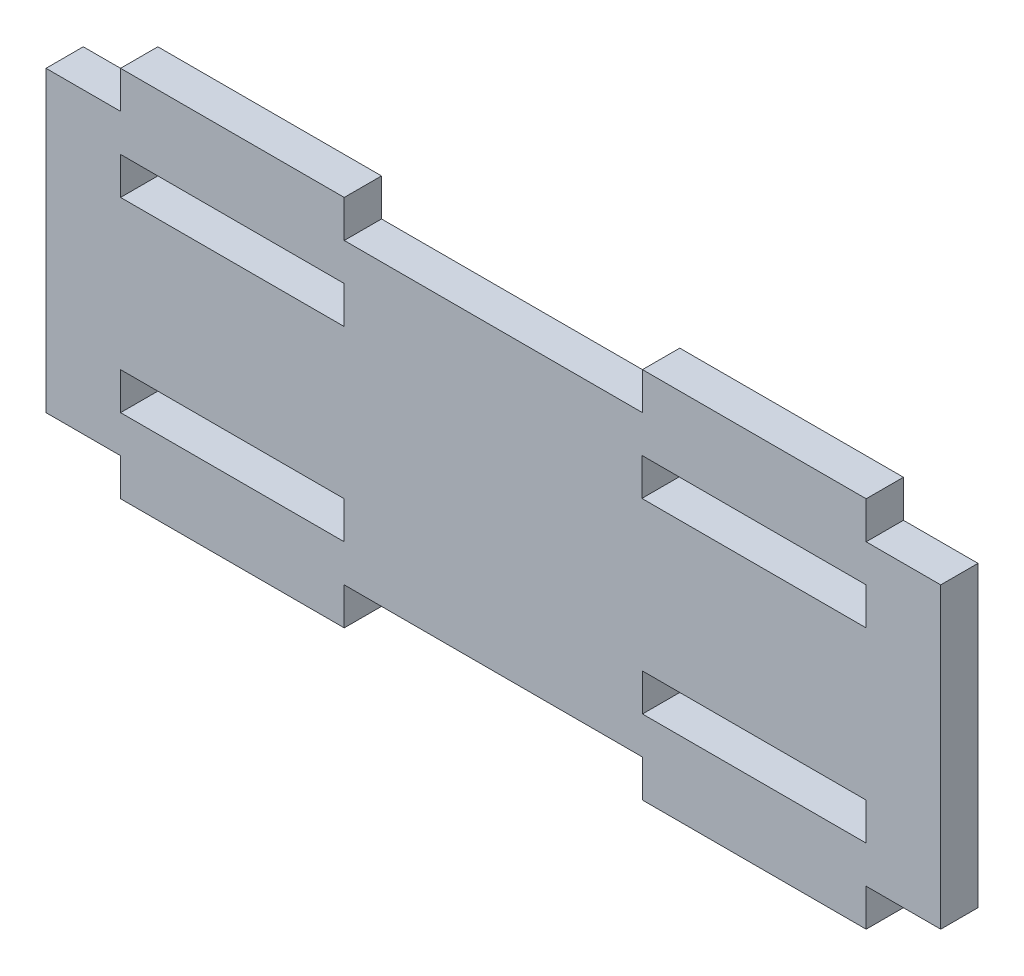
ISO-10303-21;
HEADER;
FILE_DESCRIPTION(('STEP AP214'),'2;1');
FILE_NAME('part.step','',(''),(''),'','','');
FILE_SCHEMA(('AUTOMOTIVE_DESIGN { 1 0 10303 214 1 1 1 1 }'));
ENDSEC;
DATA;
#1=APPLICATION_CONTEXT('core data for automotive mechanical design processes');
#2=APPLICATION_PROTOCOL_DEFINITION('international standard','automotive_design',2000,#1);
#3=PRODUCT_CONTEXT('',#1,'mechanical');
#4=PRODUCT('Part','Part','',(#3));
#5=PRODUCT_RELATED_PRODUCT_CATEGORY('part','',(#4));
#6=PRODUCT_DEFINITION_FORMATION('','',#4);
#7=PRODUCT_DEFINITION_CONTEXT('part definition',#1,'design');
#8=PRODUCT_DEFINITION('design','',#6,#7);
#9=PRODUCT_DEFINITION_SHAPE('','',#8);
#10=(LENGTH_UNIT() NAMED_UNIT(*) SI_UNIT(.MILLI.,.METRE.));
#11=(NAMED_UNIT(*) PLANE_ANGLE_UNIT() SI_UNIT($,.RADIAN.));
#12=(NAMED_UNIT(*) SI_UNIT($,.STERADIAN.) SOLID_ANGLE_UNIT());
#13=UNCERTAINTY_MEASURE_WITH_UNIT(LENGTH_MEASURE(1.E-05),#10,'distance_accuracy_value','');
#14=(GEOMETRIC_REPRESENTATION_CONTEXT(3) GLOBAL_UNCERTAINTY_ASSIGNED_CONTEXT((#13)) GLOBAL_UNIT_ASSIGNED_CONTEXT((#10,
#11,#12)) REPRESENTATION_CONTEXT('',''));
#15=CARTESIAN_POINT('',(0.,0.,0.));
#16=DIRECTION('',(0.,0.,1.));
#17=DIRECTION('',(1.,0.,0.));
#18=AXIS2_PLACEMENT_3D('',#15,#16,#17);
#19=CARTESIAN_POINT('',(0.,-9.99999999999999,5.));
#20=DIRECTION('',(0.,1.,0.));
#21=DIRECTION('',(0.,0.,1.));
#22=AXIS2_PLACEMENT_3D('',#19,#20,#21);
#23=PLANE('',#22);
#24=DIRECTION('',(1.,0.,0.));
#25=VECTOR('',#24,1.);
#26=CARTESIAN_POINT('',(0.,-9.99999999999999,0.));
#27=LINE('',#26,#25);
#28=CARTESIAN_POINT('',(20.,-9.99999999999999,0.));
#29=VERTEX_POINT('',#28);
#30=CARTESIAN_POINT('',(50.,-9.99999999999999,0.));
#31=VERTEX_POINT('',#30);
#32=EDGE_CURVE('E386',#29,#31,#27,.T.);
#33=ORIENTED_EDGE('',*,*,#32,.T.);
#34=DIRECTION('',(0.,0.,-1.));
#35=VECTOR('',#34,1.);
#36=CARTESIAN_POINT('',(50.,-9.99999999999999,5.));
#37=LINE('',#36,#35);
#38=CARTESIAN_POINT('',(50.,-9.99999999999999,5.));
#39=VERTEX_POINT('',#38);
#40=EDGE_CURVE('E11',#39,#31,#37,.T.);
#41=ORIENTED_EDGE('',*,*,#40,.F.);
#42=DIRECTION('',(1.,0.,0.));
#43=VECTOR('',#42,1.);
#44=CARTESIAN_POINT('',(0.,-9.99999999999999,5.));
#45=LINE('',#44,#43);
#46=CARTESIAN_POINT('',(20.,-9.99999999999999,5.));
#47=VERTEX_POINT('',#46);
#48=EDGE_CURVE('E282',#47,#39,#45,.T.);
#49=ORIENTED_EDGE('',*,*,#48,.F.);
#50=DIRECTION('',(0.,0.,-1.));
#51=VECTOR('',#50,1.);
#52=CARTESIAN_POINT('',(20.,-9.99999999999999,5.));
#53=LINE('',#52,#51);
#54=EDGE_CURVE('E54',#47,#29,#53,.T.);
#55=ORIENTED_EDGE('',*,*,#54,.T.);
#56=EDGE_LOOP('',(#33,#41,#49,#55));
#57=FACE_BOUND('',#56,.T.);
#58=ADVANCED_FACE('F35',(#57),#23,.F.);
#59=CARTESIAN_POINT('',(50.,0.,5.));
#60=DIRECTION('',(1.,0.,0.));
#61=DIRECTION('',(0.,0.,-1.));
#62=AXIS2_PLACEMENT_3D('',#59,#60,#61);
#63=PLANE('',#62);
#64=DIRECTION('',(0.,-1.,0.));
#65=VECTOR('',#64,1.);
#66=CARTESIAN_POINT('',(50.,0.,0.));
#67=LINE('',#66,#65);
#68=CARTESIAN_POINT('',(50.,-15.,0.));
#69=VERTEX_POINT('',#68);
#70=EDGE_CURVE('E288',#31,#69,#67,.T.);
#71=ORIENTED_EDGE('',*,*,#70,.T.);
#72=DIRECTION('',(0.,0.,-1.));
#73=VECTOR('',#72,1.);
#74=CARTESIAN_POINT('',(50.,-15.,5.));
#75=LINE('',#74,#73);
#76=CARTESIAN_POINT('',(50.,-15.,5.));
#77=VERTEX_POINT('',#76);
#78=EDGE_CURVE('E45',#77,#69,#75,.T.);
#79=ORIENTED_EDGE('',*,*,#78,.F.);
#80=DIRECTION('',(0.,-1.,0.));
#81=VECTOR('',#80,1.);
#82=CARTESIAN_POINT('',(50.,0.,5.));
#83=LINE('',#82,#81);
#84=EDGE_CURVE('E276',#39,#77,#83,.T.);
#85=ORIENTED_EDGE('',*,*,#84,.F.);
#86=ORIENTED_EDGE('',*,*,#40,.T.);
#87=EDGE_LOOP('',(#71,#79,#85,#86));
#88=FACE_BOUND('',#87,.T.);
#89=ADVANCED_FACE('F287',(#88),#63,.F.);
#90=CARTESIAN_POINT('',(0.,-15.,5.));
#91=DIRECTION('',(0.,1.,0.));
#92=DIRECTION('',(-1.,0.,0.));
#93=AXIS2_PLACEMENT_3D('',#90,#91,#92);
#94=PLANE('',#93);
#95=DIRECTION('',(1.,0.,0.));
#96=VECTOR('',#95,1.);
#97=CARTESIAN_POINT('',(0.,-15.,0.));
#98=LINE('',#97,#96);
#99=CARTESIAN_POINT('',(20.,-15.,0.));
#100=VERTEX_POINT('',#99);
#101=EDGE_CURVE('E389',#100,#69,#98,.T.);
#102=ORIENTED_EDGE('',*,*,#101,.F.);
#103=DIRECTION('',(0.,0.,-1.));
#104=VECTOR('',#103,1.);
#105=CARTESIAN_POINT('',(20.,-15.,5.));
#106=LINE('',#105,#104);
#107=CARTESIAN_POINT('',(20.,-15.,5.));
#108=VERTEX_POINT('',#107);
#109=EDGE_CURVE('E164',#108,#100,#106,.T.);
#110=ORIENTED_EDGE('',*,*,#109,.F.);
#111=DIRECTION('',(1.,0.,0.));
#112=VECTOR('',#111,1.);
#113=CARTESIAN_POINT('',(0.,-15.,5.));
#114=LINE('',#113,#112);
#115=EDGE_CURVE('E281',#108,#77,#114,.T.);
#116=ORIENTED_EDGE('',*,*,#115,.T.);
#117=ORIENTED_EDGE('',*,*,#78,.T.);
#118=EDGE_LOOP('',(#102,#110,#116,#117));
#119=FACE_BOUND('',#118,.T.);
#120=ADVANCED_FACE('F292',(#119),#94,.T.);
#121=CARTESIAN_POINT('',(0.,-9.99999999999999,5.));
#122=DIRECTION('',(0.,1.,0.));
#123=DIRECTION('',(0.,0.,1.));
#124=AXIS2_PLACEMENT_3D('',#121,#122,#123);
#125=PLANE('',#124);
#126=DIRECTION('',(1.,0.,0.));
#127=VECTOR('',#126,1.);
#128=CARTESIAN_POINT('',(0.,-9.99999999999999,0.));
#129=LINE('',#128,#127);
#130=CARTESIAN_POINT('',(-50.,-9.99999999999999,0.));
#131=VERTEX_POINT('',#130);
#132=CARTESIAN_POINT('',(-20.,-9.99999999999999,0.));
#133=VERTEX_POINT('',#132);
#134=EDGE_CURVE('E374',#131,#133,#129,.T.);
#135=ORIENTED_EDGE('',*,*,#134,.T.);
#136=DIRECTION('',(0.,0.,-1.));
#137=VECTOR('',#136,1.);
#138=CARTESIAN_POINT('',(-20.,-9.99999999999999,5.));
#139=LINE('',#138,#137);
#140=CARTESIAN_POINT('',(-20.,-9.99999999999999,5.));
#141=VERTEX_POINT('',#140);
#142=EDGE_CURVE('E396',#141,#133,#139,.T.);
#143=ORIENTED_EDGE('',*,*,#142,.F.);
#144=DIRECTION('',(1.,0.,0.));
#145=VECTOR('',#144,1.);
#146=CARTESIAN_POINT('',(0.,-9.99999999999999,5.));
#147=LINE('',#146,#145);
#148=CARTESIAN_POINT('',(-50.,-9.99999999999999,5.));
#149=VERTEX_POINT('',#148);
#150=EDGE_CURVE('E549',#149,#141,#147,.T.);
#151=ORIENTED_EDGE('',*,*,#150,.F.);
#152=DIRECTION('',(0.,0.,-1.));
#153=VECTOR('',#152,1.);
#154=CARTESIAN_POINT('',(-50.,-9.99999999999999,5.));
#155=LINE('',#154,#153);
#156=EDGE_CURVE('E398',#149,#131,#155,.T.);
#157=ORIENTED_EDGE('',*,*,#156,.T.);
#158=EDGE_LOOP('',(#135,#143,#151,#157));
#159=FACE_BOUND('',#158,.T.);
#160=ADVANCED_FACE('F575',(#159),#125,.F.);
#161=CARTESIAN_POINT('',(-20.,0.,5.));
#162=DIRECTION('',(1.,0.,0.));
#163=DIRECTION('',(0.,0.,-1.));
#164=AXIS2_PLACEMENT_3D('',#161,#162,#163);
#165=PLANE('',#164);
#166=DIRECTION('',(0.,-1.,0.));
#167=VECTOR('',#166,1.);
#168=CARTESIAN_POINT('',(-20.,0.,0.));
#169=LINE('',#168,#167);
#170=CARTESIAN_POINT('',(-20.,-15.,0.));
#171=VERTEX_POINT('',#170);
#172=EDGE_CURVE('E377',#133,#171,#169,.T.);
#173=ORIENTED_EDGE('',*,*,#172,.T.);
#174=DIRECTION('',(0.,0.,-1.));
#175=VECTOR('',#174,1.);
#176=CARTESIAN_POINT('',(-20.,-15.,5.));
#177=LINE('',#176,#175);
#178=CARTESIAN_POINT('',(-20.,-15.,5.));
#179=VERTEX_POINT('',#178);
#180=EDGE_CURVE('E403',#179,#171,#177,.T.);
#181=ORIENTED_EDGE('',*,*,#180,.F.);
#182=DIRECTION('',(0.,-1.,0.));
#183=VECTOR('',#182,1.);
#184=CARTESIAN_POINT('',(-20.,0.,5.));
#185=LINE('',#184,#183);
#186=EDGE_CURVE('E552',#141,#179,#185,.T.);
#187=ORIENTED_EDGE('',*,*,#186,.F.);
#188=ORIENTED_EDGE('',*,*,#142,.T.);
#189=EDGE_LOOP('',(#173,#181,#187,#188));
#190=FACE_BOUND('',#189,.T.);
#191=ADVANCED_FACE('F577',(#190),#165,.F.);
#192=CARTESIAN_POINT('',(0.,-15.,5.));
#193=DIRECTION('',(0.,1.,0.));
#194=DIRECTION('',(0.,0.,1.));
#195=AXIS2_PLACEMENT_3D('',#192,#193,#194);
#196=PLANE('',#195);
#197=DIRECTION('',(1.,0.,0.));
#198=VECTOR('',#197,1.);
#199=CARTESIAN_POINT('',(0.,-15.,0.));
#200=LINE('',#199,#198);
#201=CARTESIAN_POINT('',(-50.,-15.,0.));
#202=VERTEX_POINT('',#201);
#203=EDGE_CURVE('E380',#202,#171,#200,.T.);
#204=ORIENTED_EDGE('',*,*,#203,.F.);
#205=DIRECTION('',(0.,0.,-1.));
#206=VECTOR('',#205,1.);
#207=CARTESIAN_POINT('',(-50.,-15.,5.));
#208=LINE('',#207,#206);
#209=CARTESIAN_POINT('',(-50.,-15.,5.));
#210=VERTEX_POINT('',#209);
#211=EDGE_CURVE('E400',#210,#202,#208,.T.);
#212=ORIENTED_EDGE('',*,*,#211,.F.);
#213=DIRECTION('',(1.,0.,0.));
#214=VECTOR('',#213,1.);
#215=CARTESIAN_POINT('',(0.,-15.,5.));
#216=LINE('',#215,#214);
#217=EDGE_CURVE('E554',#210,#179,#216,.T.);
#218=ORIENTED_EDGE('',*,*,#217,.T.);
#219=ORIENTED_EDGE('',*,*,#180,.T.);
#220=EDGE_LOOP('',(#204,#212,#218,#219));
#221=FACE_BOUND('',#220,.T.);
#222=ADVANCED_FACE('F570',(#221),#196,.T.);
#223=CARTESIAN_POINT('',(0.,15.,5.));
#224=DIRECTION('',(0.,1.,0.));
#225=DIRECTION('',(0.,0.,1.));
#226=AXIS2_PLACEMENT_3D('',#223,#224,#225);
#227=PLANE('',#226);
#228=DIRECTION('',(1.,0.,0.));
#229=VECTOR('',#228,1.);
#230=CARTESIAN_POINT('',(0.,15.,0.));
#231=LINE('',#230,#229);
#232=CARTESIAN_POINT('',(-50.,15.,0.));
#233=VERTEX_POINT('',#232);
#234=CARTESIAN_POINT('',(-20.,15.,0.));
#235=VERTEX_POINT('',#234);
#236=EDGE_CURVE('E362',#233,#235,#231,.T.);
#237=ORIENTED_EDGE('',*,*,#236,.T.);
#238=DIRECTION('',(0.,0.,-1.));
#239=VECTOR('',#238,1.);
#240=CARTESIAN_POINT('',(-20.,15.,5.));
#241=LINE('',#240,#239);
#242=CARTESIAN_POINT('',(-20.,15.,5.));
#243=VERTEX_POINT('',#242);
#244=EDGE_CURVE('E401',#243,#235,#241,.T.);
#245=ORIENTED_EDGE('',*,*,#244,.F.);
#246=DIRECTION('',(1.,0.,0.));
#247=VECTOR('',#246,1.);
#248=CARTESIAN_POINT('',(0.,15.,5.));
#249=LINE('',#248,#247);
#250=CARTESIAN_POINT('',(-50.,15.,5.));
#251=VERTEX_POINT('',#250);
#252=EDGE_CURVE('E538',#251,#243,#249,.T.);
#253=ORIENTED_EDGE('',*,*,#252,.F.);
#254=DIRECTION('',(0.,0.,-1.));
#255=VECTOR('',#254,1.);
#256=CARTESIAN_POINT('',(-50.,15.,5.));
#257=LINE('',#256,#255);
#258=EDGE_CURVE('E407',#251,#233,#257,.T.);
#259=ORIENTED_EDGE('',*,*,#258,.T.);
#260=EDGE_LOOP('',(#237,#245,#253,#259));
#261=FACE_BOUND('',#260,.T.);
#262=ADVANCED_FACE('F584',(#261),#227,.F.);
#263=CARTESIAN_POINT('',(-20.,0.,5.));
#264=DIRECTION('',(1.,0.,0.));
#265=DIRECTION('',(0.,0.,-1.));
#266=AXIS2_PLACEMENT_3D('',#263,#264,#265);
#267=PLANE('',#266);
#268=DIRECTION('',(0.,-1.,0.));
#269=VECTOR('',#268,1.);
#270=CARTESIAN_POINT('',(-20.,0.,0.));
#271=LINE('',#270,#269);
#272=CARTESIAN_POINT('',(-20.,10.,0.));
#273=VERTEX_POINT('',#272);
#274=EDGE_CURVE('E365',#235,#273,#271,.T.);
#275=ORIENTED_EDGE('',*,*,#274,.T.);
#276=DIRECTION('',(0.,0.,-1.));
#277=VECTOR('',#276,1.);
#278=CARTESIAN_POINT('',(-20.,10.,5.));
#279=LINE('',#278,#277);
#280=CARTESIAN_POINT('',(-20.,10.,5.));
#281=VERTEX_POINT('',#280);
#282=EDGE_CURVE('E412',#281,#273,#279,.T.);
#283=ORIENTED_EDGE('',*,*,#282,.F.);
#284=DIRECTION('',(0.,-1.,0.));
#285=VECTOR('',#284,1.);
#286=CARTESIAN_POINT('',(-20.,0.,5.));
#287=LINE('',#286,#285);
#288=EDGE_CURVE('E541',#243,#281,#287,.T.);
#289=ORIENTED_EDGE('',*,*,#288,.F.);
#290=ORIENTED_EDGE('',*,*,#244,.T.);
#291=EDGE_LOOP('',(#275,#283,#289,#290));
#292=FACE_BOUND('',#291,.T.);
#293=ADVANCED_FACE('F682',(#292),#267,.F.);
#294=CARTESIAN_POINT('',(0.,10.,5.));
#295=DIRECTION('',(0.,1.,0.));
#296=DIRECTION('',(0.,0.,1.));
#297=AXIS2_PLACEMENT_3D('',#294,#295,#296);
#298=PLANE('',#297);
#299=DIRECTION('',(1.,0.,0.));
#300=VECTOR('',#299,1.);
#301=CARTESIAN_POINT('',(0.,10.,0.));
#302=LINE('',#301,#300);
#303=CARTESIAN_POINT('',(-50.,10.,0.));
#304=VERTEX_POINT('',#303);
#305=EDGE_CURVE('E368',#304,#273,#302,.T.);
#306=ORIENTED_EDGE('',*,*,#305,.F.);
#307=DIRECTION('',(0.,0.,-1.));
#308=VECTOR('',#307,1.);
#309=CARTESIAN_POINT('',(-50.,10.,5.));
#310=LINE('',#309,#308);
#311=CARTESIAN_POINT('',(-50.,10.,5.));
#312=VERTEX_POINT('',#311);
#313=EDGE_CURVE('E409',#312,#304,#310,.T.);
#314=ORIENTED_EDGE('',*,*,#313,.F.);
#315=DIRECTION('',(1.,0.,0.));
#316=VECTOR('',#315,1.);
#317=CARTESIAN_POINT('',(0.,10.,5.));
#318=LINE('',#317,#316);
#319=EDGE_CURVE('E543',#312,#281,#318,.T.);
#320=ORIENTED_EDGE('',*,*,#319,.T.);
#321=ORIENTED_EDGE('',*,*,#282,.T.);
#322=EDGE_LOOP('',(#306,#314,#320,#321));
#323=FACE_BOUND('',#322,.T.);
#324=ADVANCED_FACE('F616',(#323),#298,.T.);
#325=CARTESIAN_POINT('',(60.,0.,5.));
#326=DIRECTION('',(1.,0.,0.));
#327=DIRECTION('',(0.,1.,0.));
#328=AXIS2_PLACEMENT_3D('',#325,#326,#327);
#329=PLANE('',#328);
#330=DIRECTION('',(0.,-1.,0.));
#331=VECTOR('',#330,1.);
#332=CARTESIAN_POINT('',(60.,0.,0.));
#333=LINE('',#332,#331);
#334=CARTESIAN_POINT('',(60.,20.,0.));
#335=VERTEX_POINT('',#334);
#336=CARTESIAN_POINT('',(60.,-20.,0.));
#337=VERTEX_POINT('',#336);
#338=EDGE_CURVE('E310',#335,#337,#333,.T.);
#339=ORIENTED_EDGE('',*,*,#338,.F.);
#340=DIRECTION('',(0.,0.,-1.));
#341=VECTOR('',#340,1.);
#342=CARTESIAN_POINT('',(60.,20.,5.));
#343=LINE('',#342,#341);
#344=CARTESIAN_POINT('',(60.,20.,5.));
#345=VERTEX_POINT('',#344);
#346=EDGE_CURVE('E410',#345,#335,#343,.T.);
#347=ORIENTED_EDGE('',*,*,#346,.F.);
#348=DIRECTION('',(0.,-1.,0.));
#349=VECTOR('',#348,1.);
#350=CARTESIAN_POINT('',(60.,0.,5.));
#351=LINE('',#350,#349);
#352=CARTESIAN_POINT('',(60.,-20.,5.));
#353=VERTEX_POINT('',#352);
#354=EDGE_CURVE('E485',#345,#353,#351,.T.);
#355=ORIENTED_EDGE('',*,*,#354,.T.);
#356=DIRECTION('',(0.,0.,-1.));
#357=VECTOR('',#356,1.);
#358=CARTESIAN_POINT('',(60.,-20.,5.));
#359=LINE('',#358,#357);
#360=EDGE_CURVE('E416',#353,#337,#359,.T.);
#361=ORIENTED_EDGE('',*,*,#360,.T.);
#362=EDGE_LOOP('',(#339,#347,#355,#361));
#363=FACE_BOUND('',#362,.T.);
#364=ADVANCED_FACE('F612',(#363),#329,.T.);
#365=CARTESIAN_POINT('',(0.,20.,5.));
#366=DIRECTION('',(0.,1.,0.));
#367=DIRECTION('',(0.,0.,1.));
#368=AXIS2_PLACEMENT_3D('',#365,#366,#367);
#369=PLANE('',#368);
#370=DIRECTION('',(1.,0.,0.));
#371=VECTOR('',#370,1.);
#372=CARTESIAN_POINT('',(0.,20.,0.));
#373=LINE('',#372,#371);
#374=CARTESIAN_POINT('',(50.,20.,0.));
#375=VERTEX_POINT('',#374);
#376=EDGE_CURVE('E313',#375,#335,#373,.T.);
#377=ORIENTED_EDGE('',*,*,#376,.F.);
#378=DIRECTION('',(0.,0.,-1.));
#379=VECTOR('',#378,1.);
#380=CARTESIAN_POINT('',(50.,20.,5.));
#381=LINE('',#380,#379);
#382=CARTESIAN_POINT('',(50.,20.,5.));
#383=VERTEX_POINT('',#382);
#384=EDGE_CURVE('E457',#383,#375,#381,.T.);
#385=ORIENTED_EDGE('',*,*,#384,.F.);
#386=DIRECTION('',(1.,0.,0.));
#387=VECTOR('',#386,1.);
#388=CARTESIAN_POINT('',(0.,20.,5.));
#389=LINE('',#388,#387);
#390=EDGE_CURVE('E489',#383,#345,#389,.T.);
#391=ORIENTED_EDGE('',*,*,#390,.T.);
#392=ORIENTED_EDGE('',*,*,#346,.T.);
#393=EDGE_LOOP('',(#377,#385,#391,#392));
#394=FACE_BOUND('',#393,.T.);
#395=ADVANCED_FACE('F615',(#394),#369,.T.);
#396=CARTESIAN_POINT('',(50.,0.,5.));
#397=DIRECTION('',(-1.,0.,0.));
#398=DIRECTION('',(0.,0.,1.));
#399=AXIS2_PLACEMENT_3D('',#396,#397,#398);
#400=PLANE('',#399);
#401=DIRECTION('',(0.,1.,0.));
#402=VECTOR('',#401,1.);
#403=CARTESIAN_POINT('',(50.,0.,0.));
#404=LINE('',#403,#402);
#405=CARTESIAN_POINT('',(50.,25.,0.));
#406=VERTEX_POINT('',#405);
#407=EDGE_CURVE('E316',#375,#406,#404,.T.);
#408=ORIENTED_EDGE('',*,*,#407,.T.);
#409=DIRECTION('',(0.,0.,-1.));
#410=VECTOR('',#409,1.);
#411=CARTESIAN_POINT('',(50.,25.,5.));
#412=LINE('',#411,#410);
#413=CARTESIAN_POINT('',(50.,25.,5.));
#414=VERTEX_POINT('',#413);
#415=EDGE_CURVE('E455',#414,#406,#412,.T.);
#416=ORIENTED_EDGE('',*,*,#415,.F.);
#417=DIRECTION('',(0.,1.,0.));
#418=VECTOR('',#417,1.);
#419=CARTESIAN_POINT('',(50.,0.,5.));
#420=LINE('',#419,#418);
#421=EDGE_CURVE('E496',#383,#414,#420,.T.);
#422=ORIENTED_EDGE('',*,*,#421,.F.);
#423=ORIENTED_EDGE('',*,*,#384,.T.);
#424=EDGE_LOOP('',(#408,#416,#422,#423));
#425=FACE_BOUND('',#424,.T.);
#426=ADVANCED_FACE('F618',(#425),#400,.F.);
#427=CARTESIAN_POINT('',(0.,25.,5.));
#428=DIRECTION('',(0.,1.,0.));
#429=DIRECTION('',(0.,0.,1.));
#430=AXIS2_PLACEMENT_3D('',#427,#428,#429);
#431=PLANE('',#430);
#432=DIRECTION('',(1.,0.,0.));
#433=VECTOR('',#432,1.);
#434=CARTESIAN_POINT('',(0.,25.,0.));
#435=LINE('',#434,#433);
#436=CARTESIAN_POINT('',(20.,25.,0.));
#437=VERTEX_POINT('',#436);
#438=EDGE_CURVE('E321',#437,#406,#435,.T.);
#439=ORIENTED_EDGE('',*,*,#438,.F.);
#440=DIRECTION('',(0.,0.,-1.));
#441=VECTOR('',#440,1.);
#442=CARTESIAN_POINT('',(20.,25.,5.));
#443=LINE('',#442,#441);
#444=CARTESIAN_POINT('',(20.,25.,5.));
#445=VERTEX_POINT('',#444);
#446=EDGE_CURVE('E453',#445,#437,#443,.T.);
#447=ORIENTED_EDGE('',*,*,#446,.F.);
#448=DIRECTION('',(1.,0.,0.));
#449=VECTOR('',#448,1.);
#450=CARTESIAN_POINT('',(0.,25.,5.));
#451=LINE('',#450,#449);
#452=EDGE_CURVE('E500',#445,#414,#451,.T.);
#453=ORIENTED_EDGE('',*,*,#452,.T.);
#454=ORIENTED_EDGE('',*,*,#415,.T.);
#455=EDGE_LOOP('',(#439,#447,#453,#454));
#456=FACE_BOUND('',#455,.T.);
#457=ADVANCED_FACE('F621',(#456),#431,.T.);
#458=CARTESIAN_POINT('',(20.,0.,5.));
#459=DIRECTION('',(-1.,0.,0.));
#460=DIRECTION('',(0.,0.,1.));
#461=AXIS2_PLACEMENT_3D('',#458,#459,#460);
#462=PLANE('',#461);
#463=DIRECTION('',(0.,1.,0.));
#464=VECTOR('',#463,1.);
#465=CARTESIAN_POINT('',(20.,0.,0.));
#466=LINE('',#465,#464);
#467=CARTESIAN_POINT('',(20.,20.,0.));
#468=VERTEX_POINT('',#467);
#469=EDGE_CURVE('E324',#468,#437,#466,.T.);
#470=ORIENTED_EDGE('',*,*,#469,.F.);
#471=DIRECTION('',(0.,0.,-1.));
#472=VECTOR('',#471,1.);
#473=CARTESIAN_POINT('',(20.,20.,5.));
#474=LINE('',#473,#472);
#475=CARTESIAN_POINT('',(20.,20.,5.));
#476=VERTEX_POINT('',#475);
#477=EDGE_CURVE('E451',#476,#468,#474,.T.);
#478=ORIENTED_EDGE('',*,*,#477,.F.);
#479=DIRECTION('',(0.,1.,0.));
#480=VECTOR('',#479,1.);
#481=CARTESIAN_POINT('',(20.,0.,5.));
#482=LINE('',#481,#480);
#483=EDGE_CURVE('E503',#476,#445,#482,.T.);
#484=ORIENTED_EDGE('',*,*,#483,.T.);
#485=ORIENTED_EDGE('',*,*,#446,.T.);
#486=EDGE_LOOP('',(#470,#478,#484,#485));
#487=FACE_BOUND('',#486,.T.);
#488=ADVANCED_FACE('F625',(#487),#462,.T.);
#489=CARTESIAN_POINT('',(-20.,20.,0.));
#490=VERTEX_POINT('',#489);
#491=EDGE_CURVE('E318',#490,#468,#373,.T.);
#492=ORIENTED_EDGE('',*,*,#491,.F.);
#493=DIRECTION('',(0.,0.,-1.));
#494=VECTOR('',#493,1.);
#495=CARTESIAN_POINT('',(-20.,20.,5.));
#496=LINE('',#495,#494);
#497=CARTESIAN_POINT('',(-20.,20.,5.));
#498=VERTEX_POINT('',#497);
#499=EDGE_CURVE('E449',#498,#490,#496,.T.);
#500=ORIENTED_EDGE('',*,*,#499,.F.);
#501=EDGE_CURVE('E498',#498,#476,#389,.T.);
#502=ORIENTED_EDGE('',*,*,#501,.T.);
#503=ORIENTED_EDGE('',*,*,#477,.T.);
#504=EDGE_LOOP('',(#492,#500,#502,#503));
#505=FACE_BOUND('',#504,.T.);
#506=ADVANCED_FACE('F629',(#505),#369,.T.);
#507=CARTESIAN_POINT('',(-20.,0.,5.));
#508=DIRECTION('',(-1.,0.,0.));
#509=DIRECTION('',(0.,0.,1.));
#510=AXIS2_PLACEMENT_3D('',#507,#508,#509);
#511=PLANE('',#510);
#512=DIRECTION('',(0.,1.,0.));
#513=VECTOR('',#512,1.);
#514=CARTESIAN_POINT('',(-20.,0.,0.));
#515=LINE('',#514,#513);
#516=CARTESIAN_POINT('',(-20.,25.,0.));
#517=VERTEX_POINT('',#516);
#518=EDGE_CURVE('E327',#490,#517,#515,.T.);
#519=ORIENTED_EDGE('',*,*,#518,.T.);
#520=DIRECTION('',(0.,0.,-1.));
#521=VECTOR('',#520,1.);
#522=CARTESIAN_POINT('',(-20.,25.,5.));
#523=LINE('',#522,#521);
#524=CARTESIAN_POINT('',(-20.,25.,5.));
#525=VERTEX_POINT('',#524);
#526=EDGE_CURVE('E447',#525,#517,#523,.T.);
#527=ORIENTED_EDGE('',*,*,#526,.F.);
#528=DIRECTION('',(0.,1.,0.));
#529=VECTOR('',#528,1.);
#530=CARTESIAN_POINT('',(-20.,0.,5.));
#531=LINE('',#530,#529);
#532=EDGE_CURVE('E506',#498,#525,#531,.T.);
#533=ORIENTED_EDGE('',*,*,#532,.F.);
#534=ORIENTED_EDGE('',*,*,#499,.T.);
#535=EDGE_LOOP('',(#519,#527,#533,#534));
#536=FACE_BOUND('',#535,.T.);
#537=ADVANCED_FACE('F631',(#536),#511,.F.);
#538=CARTESIAN_POINT('',(0.,25.,5.));
#539=DIRECTION('',(0.,1.,0.));
#540=DIRECTION('',(0.,0.,1.));
#541=AXIS2_PLACEMENT_3D('',#538,#539,#540);
#542=PLANE('',#541);
#543=DIRECTION('',(1.,0.,0.));
#544=VECTOR('',#543,1.);
#545=CARTESIAN_POINT('',(0.,25.,0.));
#546=LINE('',#545,#544);
#547=CARTESIAN_POINT('',(-50.,25.,0.));
#548=VERTEX_POINT('',#547);
#549=EDGE_CURVE('E330',#548,#517,#546,.T.);
#550=ORIENTED_EDGE('',*,*,#549,.F.);
#551=DIRECTION('',(0.,0.,-1.));
#552=VECTOR('',#551,1.);
#553=CARTESIAN_POINT('',(-50.,25.,5.));
#554=LINE('',#553,#552);
#555=CARTESIAN_POINT('',(-50.,25.,5.));
#556=VERTEX_POINT('',#555);
#557=EDGE_CURVE('E445',#556,#548,#554,.T.);
#558=ORIENTED_EDGE('',*,*,#557,.F.);
#559=DIRECTION('',(1.,0.,0.));
#560=VECTOR('',#559,1.);
#561=CARTESIAN_POINT('',(0.,25.,5.));
#562=LINE('',#561,#560);
#563=EDGE_CURVE('E508',#556,#525,#562,.T.);
#564=ORIENTED_EDGE('',*,*,#563,.T.);
#565=ORIENTED_EDGE('',*,*,#526,.T.);
#566=EDGE_LOOP('',(#550,#558,#564,#565));
#567=FACE_BOUND('',#566,.T.);
#568=ADVANCED_FACE('F634',(#567),#542,.T.);
#569=CARTESIAN_POINT('',(-50.,0.,5.));
#570=DIRECTION('',(-1.,0.,0.));
#571=DIRECTION('',(0.,0.,1.));
#572=AXIS2_PLACEMENT_3D('',#569,#570,#571);
#573=PLANE('',#572);
#574=DIRECTION('',(0.,1.,0.));
#575=VECTOR('',#574,1.);
#576=CARTESIAN_POINT('',(-50.,0.,0.));
#577=LINE('',#576,#575);
#578=CARTESIAN_POINT('',(-50.,20.,0.));
#579=VERTEX_POINT('',#578);
#580=EDGE_CURVE('E333',#579,#548,#577,.T.);
#581=ORIENTED_EDGE('',*,*,#580,.F.);
#582=DIRECTION('',(0.,0.,-1.));
#583=VECTOR('',#582,1.);
#584=CARTESIAN_POINT('',(-50.,20.,5.));
#585=LINE('',#584,#583);
#586=CARTESIAN_POINT('',(-50.,20.,5.));
#587=VERTEX_POINT('',#586);
#588=EDGE_CURVE('E443',#587,#579,#585,.T.);
#589=ORIENTED_EDGE('',*,*,#588,.F.);
#590=DIRECTION('',(0.,1.,0.));
#591=VECTOR('',#590,1.);
#592=CARTESIAN_POINT('',(-50.,0.,5.));
#593=LINE('',#592,#591);
#594=EDGE_CURVE('E511',#587,#556,#593,.T.);
#595=ORIENTED_EDGE('',*,*,#594,.T.);
#596=ORIENTED_EDGE('',*,*,#557,.T.);
#597=EDGE_LOOP('',(#581,#589,#595,#596));
#598=FACE_BOUND('',#597,.T.);
#599=ADVANCED_FACE('F638',(#598),#573,.T.);
#600=CARTESIAN_POINT('',(-60.,20.,0.));
#601=VERTEX_POINT('',#600);
#602=EDGE_CURVE('E317',#601,#579,#373,.T.);
#603=ORIENTED_EDGE('',*,*,#602,.F.);
#604=DIRECTION('',(0.,0.,-1.));
#605=VECTOR('',#604,1.);
#606=CARTESIAN_POINT('',(-60.,20.,5.));
#607=LINE('',#606,#605);
#608=CARTESIAN_POINT('',(-60.,20.,5.));
#609=VERTEX_POINT('',#608);
#610=EDGE_CURVE('E441',#609,#601,#607,.T.);
#611=ORIENTED_EDGE('',*,*,#610,.F.);
#612=EDGE_CURVE('E497',#609,#587,#389,.T.);
#613=ORIENTED_EDGE('',*,*,#612,.T.);
#614=ORIENTED_EDGE('',*,*,#588,.T.);
#615=EDGE_LOOP('',(#603,#611,#613,#614));
#616=FACE_BOUND('',#615,.T.);
#617=ADVANCED_FACE('F642',(#616),#369,.T.);
#618=CARTESIAN_POINT('',(-60.,0.,5.));
#619=DIRECTION('',(1.,0.,0.));
#620=DIRECTION('',(0.,0.,-1.));
#621=AXIS2_PLACEMENT_3D('',#618,#619,#620);
#622=PLANE('',#621);
#623=DIRECTION('',(0.,-1.,0.));
#624=VECTOR('',#623,1.);
#625=CARTESIAN_POINT('',(-60.,0.,0.));
#626=LINE('',#625,#624);
#627=CARTESIAN_POINT('',(-60.,-20.,0.));
#628=VERTEX_POINT('',#627);
#629=EDGE_CURVE('E336',#601,#628,#626,.T.);
#630=ORIENTED_EDGE('',*,*,#629,.T.);
#631=DIRECTION('',(0.,0.,-1.));
#632=VECTOR('',#631,1.);
#633=CARTESIAN_POINT('',(-60.,-20.,5.));
#634=LINE('',#633,#632);
#635=CARTESIAN_POINT('',(-60.,-20.,5.));
#636=VERTEX_POINT('',#635);
#637=EDGE_CURVE('E438',#636,#628,#634,.T.);
#638=ORIENTED_EDGE('',*,*,#637,.F.);
#639=DIRECTION('',(0.,-1.,0.));
#640=VECTOR('',#639,1.);
#641=CARTESIAN_POINT('',(-60.,0.,5.));
#642=LINE('',#641,#640);
#643=EDGE_CURVE('E514',#609,#636,#642,.T.);
#644=ORIENTED_EDGE('',*,*,#643,.F.);
#645=ORIENTED_EDGE('',*,*,#610,.T.);
#646=EDGE_LOOP('',(#630,#638,#644,#645));
#647=FACE_BOUND('',#646,.T.);
#648=ADVANCED_FACE('F646',(#647),#622,.F.);
#649=CARTESIAN_POINT('',(0.,-20.,5.));
#650=DIRECTION('',(0.,1.,0.));
#651=DIRECTION('',(-1.,0.,0.));
#652=AXIS2_PLACEMENT_3D('',#649,#650,#651);
#653=PLANE('',#652);
#654=DIRECTION('',(1.,0.,0.));
#655=VECTOR('',#654,1.);
#656=CARTESIAN_POINT('',(0.,-20.,0.));
#657=LINE('',#656,#655);
#658=CARTESIAN_POINT('',(-50.,-20.,0.));
#659=VERTEX_POINT('',#658);
#660=EDGE_CURVE('E339',#628,#659,#657,.T.);
#661=ORIENTED_EDGE('',*,*,#660,.T.);
#662=DIRECTION('',(0.,0.,-1.));
#663=VECTOR('',#662,1.);
#664=CARTESIAN_POINT('',(-50.,-20.,5.));
#665=LINE('',#664,#663);
#666=CARTESIAN_POINT('',(-50.,-20.,5.));
#667=VERTEX_POINT('',#666);
#668=EDGE_CURVE('E435',#667,#659,#665,.T.);
#669=ORIENTED_EDGE('',*,*,#668,.F.);
#670=DIRECTION('',(1.,0.,0.));
#671=VECTOR('',#670,1.);
#672=CARTESIAN_POINT('',(0.,-20.,5.));
#673=LINE('',#672,#671);
#674=EDGE_CURVE('E517',#636,#667,#673,.T.);
#675=ORIENTED_EDGE('',*,*,#674,.F.);
#676=ORIENTED_EDGE('',*,*,#637,.T.);
#677=EDGE_LOOP('',(#661,#669,#675,#676));
#678=FACE_BOUND('',#677,.T.);
#679=ADVANCED_FACE('F650',(#678),#653,.F.);
#680=CARTESIAN_POINT('',(-50.,0.,5.));
#681=DIRECTION('',(1.,0.,0.));
#682=DIRECTION('',(0.,1.,0.));
#683=AXIS2_PLACEMENT_3D('',#680,#681,#682);
#684=PLANE('',#683);
#685=DIRECTION('',(0.,-1.,0.));
#686=VECTOR('',#685,1.);
#687=CARTESIAN_POINT('',(-50.,0.,0.));
#688=LINE('',#687,#686);
#689=CARTESIAN_POINT('',(-50.,-25.,0.));
#690=VERTEX_POINT('',#689);
#691=EDGE_CURVE('E342',#659,#690,#688,.T.);
#692=ORIENTED_EDGE('',*,*,#691,.T.);
#693=DIRECTION('',(0.,0.,-1.));
#694=VECTOR('',#693,1.);
#695=CARTESIAN_POINT('',(-50.,-25.,5.));
#696=LINE('',#695,#694);
#697=CARTESIAN_POINT('',(-50.,-25.,5.));
#698=VERTEX_POINT('',#697);
#699=EDGE_CURVE('E432',#698,#690,#696,.T.);
#700=ORIENTED_EDGE('',*,*,#699,.F.);
#701=DIRECTION('',(0.,-1.,0.));
#702=VECTOR('',#701,1.);
#703=CARTESIAN_POINT('',(-50.,0.,5.));
#704=LINE('',#703,#702);
#705=EDGE_CURVE('E520',#667,#698,#704,.T.);
#706=ORIENTED_EDGE('',*,*,#705,.F.);
#707=ORIENTED_EDGE('',*,*,#668,.T.);
#708=EDGE_LOOP('',(#692,#700,#706,#707));
#709=FACE_BOUND('',#708,.T.);
#710=ADVANCED_FACE('F652',(#709),#684,.F.);
#711=CARTESIAN_POINT('',(0.,-25.,5.));
#712=DIRECTION('',(0.,1.,0.));
#713=DIRECTION('',(0.,0.,1.));
#714=AXIS2_PLACEMENT_3D('',#711,#712,#713);
#715=PLANE('',#714);
#716=DIRECTION('',(1.,0.,0.));
#717=VECTOR('',#716,1.);
#718=CARTESIAN_POINT('',(0.,-25.,0.));
#719=LINE('',#718,#717);
#720=CARTESIAN_POINT('',(-20.,-25.,0.));
#721=VERTEX_POINT('',#720);
#722=EDGE_CURVE('E347',#690,#721,#719,.T.);
#723=ORIENTED_EDGE('',*,*,#722,.T.);
#724=DIRECTION('',(0.,0.,-1.));
#725=VECTOR('',#724,1.);
#726=CARTESIAN_POINT('',(-20.,-25.,5.));
#727=LINE('',#726,#725);
#728=CARTESIAN_POINT('',(-20.,-25.,5.));
#729=VERTEX_POINT('',#728);
#730=EDGE_CURVE('E430',#729,#721,#727,.T.);
#731=ORIENTED_EDGE('',*,*,#730,.F.);
#732=DIRECTION('',(1.,0.,0.));
#733=VECTOR('',#732,1.);
#734=CARTESIAN_POINT('',(0.,-25.,5.));
#735=LINE('',#734,#733);
#736=EDGE_CURVE('E525',#698,#729,#735,.T.);
#737=ORIENTED_EDGE('',*,*,#736,.F.);
#738=ORIENTED_EDGE('',*,*,#699,.T.);
#739=EDGE_LOOP('',(#723,#731,#737,#738));
#740=FACE_BOUND('',#739,.T.);
#741=ADVANCED_FACE('F655',(#740),#715,.F.);
#742=CARTESIAN_POINT('',(-20.,0.,5.));
#743=DIRECTION('',(1.,0.,0.));
#744=DIRECTION('',(0.,0.,-1.));
#745=AXIS2_PLACEMENT_3D('',#742,#743,#744);
#746=PLANE('',#745);
#747=DIRECTION('',(0.,-1.,0.));
#748=VECTOR('',#747,1.);
#749=CARTESIAN_POINT('',(-20.,0.,0.));
#750=LINE('',#749,#748);
#751=CARTESIAN_POINT('',(-20.,-20.,0.));
#752=VERTEX_POINT('',#751);
#753=EDGE_CURVE('E350',#752,#721,#750,.T.);
#754=ORIENTED_EDGE('',*,*,#753,.F.);
#755=DIRECTION('',(0.,0.,-1.));
#756=VECTOR('',#755,1.);
#757=CARTESIAN_POINT('',(-20.,-20.,5.));
#758=LINE('',#757,#756);
#759=CARTESIAN_POINT('',(-20.,-20.,5.));
#760=VERTEX_POINT('',#759);
#761=EDGE_CURVE('E428',#760,#752,#758,.T.);
#762=ORIENTED_EDGE('',*,*,#761,.F.);
#763=DIRECTION('',(0.,-1.,0.));
#764=VECTOR('',#763,1.);
#765=CARTESIAN_POINT('',(-20.,0.,5.));
#766=LINE('',#765,#764);
#767=EDGE_CURVE('E527',#760,#729,#766,.T.);
#768=ORIENTED_EDGE('',*,*,#767,.T.);
#769=ORIENTED_EDGE('',*,*,#730,.T.);
#770=EDGE_LOOP('',(#754,#762,#768,#769));
#771=FACE_BOUND('',#770,.T.);
#772=ADVANCED_FACE('F659',(#771),#746,.T.);
#773=CARTESIAN_POINT('',(20.,-20.,0.));
#774=VERTEX_POINT('',#773);
#775=EDGE_CURVE('E344',#752,#774,#657,.T.);
#776=ORIENTED_EDGE('',*,*,#775,.T.);
#777=DIRECTION('',(0.,0.,-1.));
#778=VECTOR('',#777,1.);
#779=CARTESIAN_POINT('',(20.,-20.,5.));
#780=LINE('',#779,#778);
#781=CARTESIAN_POINT('',(20.,-20.,5.));
#782=VERTEX_POINT('',#781);
#783=EDGE_CURVE('E425',#782,#774,#780,.T.);
#784=ORIENTED_EDGE('',*,*,#783,.F.);
#785=EDGE_CURVE('E522',#760,#782,#673,.T.);
#786=ORIENTED_EDGE('',*,*,#785,.F.);
#787=ORIENTED_EDGE('',*,*,#761,.T.);
#788=EDGE_LOOP('',(#776,#784,#786,#787));
#789=FACE_BOUND('',#788,.T.);
#790=ADVANCED_FACE('F663',(#789),#653,.F.);
#791=CARTESIAN_POINT('',(20.,0.,5.));
#792=DIRECTION('',(1.,0.,0.));
#793=DIRECTION('',(0.,0.,-1.));
#794=AXIS2_PLACEMENT_3D('',#791,#792,#793);
#795=PLANE('',#794);
#796=DIRECTION('',(0.,-1.,0.));
#797=VECTOR('',#796,1.);
#798=CARTESIAN_POINT('',(20.,0.,0.));
#799=LINE('',#798,#797);
#800=CARTESIAN_POINT('',(20.,-25.,0.));
#801=VERTEX_POINT('',#800);
#802=EDGE_CURVE('E353',#774,#801,#799,.T.);
#803=ORIENTED_EDGE('',*,*,#802,.T.);
#804=DIRECTION('',(0.,0.,-1.));
#805=VECTOR('',#804,1.);
#806=CARTESIAN_POINT('',(20.,-25.,5.));
#807=LINE('',#806,#805);
#808=CARTESIAN_POINT('',(20.,-25.,5.));
#809=VERTEX_POINT('',#808);
#810=EDGE_CURVE('E422',#809,#801,#807,.T.);
#811=ORIENTED_EDGE('',*,*,#810,.F.);
#812=DIRECTION('',(0.,-1.,0.));
#813=VECTOR('',#812,1.);
#814=CARTESIAN_POINT('',(20.,0.,5.));
#815=LINE('',#814,#813);
#816=EDGE_CURVE('E530',#782,#809,#815,.T.);
#817=ORIENTED_EDGE('',*,*,#816,.F.);
#818=ORIENTED_EDGE('',*,*,#783,.T.);
#819=EDGE_LOOP('',(#803,#811,#817,#818));
#820=FACE_BOUND('',#819,.T.);
#821=ADVANCED_FACE('F665',(#820),#795,.F.);
#822=CARTESIAN_POINT('',(0.,-25.,5.));
#823=DIRECTION('',(0.,1.,0.));
#824=DIRECTION('',(0.,0.,1.));
#825=AXIS2_PLACEMENT_3D('',#822,#823,#824);
#826=PLANE('',#825);
#827=DIRECTION('',(1.,0.,0.));
#828=VECTOR('',#827,1.);
#829=CARTESIAN_POINT('',(0.,-25.,0.));
#830=LINE('',#829,#828);
#831=CARTESIAN_POINT('',(50.,-25.,0.));
#832=VERTEX_POINT('',#831);
#833=EDGE_CURVE('E356',#801,#832,#830,.T.);
#834=ORIENTED_EDGE('',*,*,#833,.T.);
#835=DIRECTION('',(0.,0.,-1.));
#836=VECTOR('',#835,1.);
#837=CARTESIAN_POINT('',(50.,-25.,5.));
#838=LINE('',#837,#836);
#839=CARTESIAN_POINT('',(50.,-25.,5.));
#840=VERTEX_POINT('',#839);
#841=EDGE_CURVE('E420',#840,#832,#838,.T.);
#842=ORIENTED_EDGE('',*,*,#841,.F.);
#843=DIRECTION('',(1.,0.,0.));
#844=VECTOR('',#843,1.);
#845=CARTESIAN_POINT('',(0.,-25.,5.));
#846=LINE('',#845,#844);
#847=EDGE_CURVE('E533',#809,#840,#846,.T.);
#848=ORIENTED_EDGE('',*,*,#847,.F.);
#849=ORIENTED_EDGE('',*,*,#810,.T.);
#850=EDGE_LOOP('',(#834,#842,#848,#849));
#851=FACE_BOUND('',#850,.T.);
#852=ADVANCED_FACE('F668',(#851),#826,.F.);
#853=CARTESIAN_POINT('',(50.,0.,5.));
#854=DIRECTION('',(1.,0.,0.));
#855=DIRECTION('',(0.,0.,-1.));
#856=AXIS2_PLACEMENT_3D('',#853,#854,#855);
#857=PLANE('',#856);
#858=DIRECTION('',(0.,-1.,0.));
#859=VECTOR('',#858,1.);
#860=CARTESIAN_POINT('',(50.,0.,0.));
#861=LINE('',#860,#859);
#862=CARTESIAN_POINT('',(50.,-20.,0.));
#863=VERTEX_POINT('',#862);
#864=EDGE_CURVE('E359',#863,#832,#861,.T.);
#865=ORIENTED_EDGE('',*,*,#864,.F.);
#866=DIRECTION('',(0.,0.,-1.));
#867=VECTOR('',#866,1.);
#868=CARTESIAN_POINT('',(50.,-20.,5.));
#869=LINE('',#868,#867);
#870=CARTESIAN_POINT('',(50.,-20.,5.));
#871=VERTEX_POINT('',#870);
#872=EDGE_CURVE('E418',#871,#863,#869,.T.);
#873=ORIENTED_EDGE('',*,*,#872,.F.);
#874=DIRECTION('',(0.,-1.,0.));
#875=VECTOR('',#874,1.);
#876=CARTESIAN_POINT('',(50.,0.,5.));
#877=LINE('',#876,#875);
#878=EDGE_CURVE('E535',#871,#840,#877,.T.);
#879=ORIENTED_EDGE('',*,*,#878,.T.);
#880=ORIENTED_EDGE('',*,*,#841,.T.);
#881=EDGE_LOOP('',(#865,#873,#879,#880));
#882=FACE_BOUND('',#881,.T.);
#883=ADVANCED_FACE('F672',(#882),#857,.T.);
#884=CARTESIAN_POINT('',(49.9930106618827,0.,5.));
#885=DIRECTION('',(-1.,0.,0.));
#886=DIRECTION('',(0.,0.,1.));
#887=AXIS2_PLACEMENT_3D('',#884,#885,#886);
#888=PLANE('',#887);
#889=DIRECTION('',(0.,1.,0.));
#890=VECTOR('',#889,1.);
#891=CARTESIAN_POINT('',(49.9930106618827,0.,0.));
#892=LINE('',#891,#890);
#893=CARTESIAN_POINT('',(49.9930106618827,10.,0.));
#894=VERTEX_POINT('',#893);
#895=CARTESIAN_POINT('',(49.9930106618827,15.,0.));
#896=VERTEX_POINT('',#895);
#897=EDGE_CURVE('E299',#894,#896,#892,.T.);
#898=ORIENTED_EDGE('',*,*,#897,.F.);
#899=DIRECTION('',(0.,0.,-1.));
#900=VECTOR('',#899,1.);
#901=CARTESIAN_POINT('',(49.9930106618827,10.,5.));
#902=LINE('',#901,#900);
#903=CARTESIAN_POINT('',(49.9930106618827,10.,5.));
#904=VERTEX_POINT('',#903);
#905=EDGE_CURVE('E39',#904,#894,#902,.T.);
#906=ORIENTED_EDGE('',*,*,#905,.F.);
#907=DIRECTION('',(0.,1.,0.));
#908=VECTOR('',#907,1.);
#909=CARTESIAN_POINT('',(49.9930106618827,0.,5.));
#910=LINE('',#909,#908);
#911=CARTESIAN_POINT('',(49.9930106618827,15.,5.));
#912=VERTEX_POINT('',#911);
#913=EDGE_CURVE('E394',#904,#912,#910,.T.);
#914=ORIENTED_EDGE('',*,*,#913,.T.);
#915=DIRECTION('',(0.,0.,-1.));
#916=VECTOR('',#915,1.);
#917=CARTESIAN_POINT('',(49.9930106618827,15.,5.));
#918=LINE('',#917,#916);
#919=EDGE_CURVE('E295',#912,#896,#918,.T.);
#920=ORIENTED_EDGE('',*,*,#919,.T.);
#921=EDGE_LOOP('',(#898,#906,#914,#920));
#922=FACE_BOUND('',#921,.T.);
#923=ADVANCED_FACE('F37',(#922),#888,.T.);
#924=CARTESIAN_POINT('',(0.,10.,5.));
#925=DIRECTION('',(0.,1.,0.));
#926=DIRECTION('',(0.,0.,1.));
#927=AXIS2_PLACEMENT_3D('',#924,#925,#926);
#928=PLANE('',#927);
#929=DIRECTION('',(1.,0.,0.));
#930=VECTOR('',#929,1.);
#931=CARTESIAN_POINT('',(0.,10.,0.));
#932=LINE('',#931,#930);
#933=CARTESIAN_POINT('',(19.919917746149,10.,0.));
#934=VERTEX_POINT('',#933);
#935=EDGE_CURVE('E302',#934,#894,#932,.T.);
#936=ORIENTED_EDGE('',*,*,#935,.F.);
#937=DIRECTION('',(0.,0.,-1.));
#938=VECTOR('',#937,1.);
#939=CARTESIAN_POINT('',(19.919917746149,10.,5.));
#940=LINE('',#939,#938);
#941=CARTESIAN_POINT('',(19.919917746149,10.,5.));
#942=VERTEX_POINT('',#941);
#943=EDGE_CURVE('E463',#942,#934,#940,.T.);
#944=ORIENTED_EDGE('',*,*,#943,.F.);
#945=DIRECTION('',(1.,0.,0.));
#946=VECTOR('',#945,1.);
#947=CARTESIAN_POINT('',(0.,10.,5.));
#948=LINE('',#947,#946);
#949=EDGE_CURVE('E472',#942,#904,#948,.T.);
#950=ORIENTED_EDGE('',*,*,#949,.T.);
#951=ORIENTED_EDGE('',*,*,#905,.T.);
#952=EDGE_LOOP('',(#936,#944,#950,#951));
#953=FACE_BOUND('',#952,.T.);
#954=ADVANCED_FACE('F470',(#953),#928,.T.);
#955=CARTESIAN_POINT('',(19.919917746149,0.,5.));
#956=DIRECTION('',(-1.,0.,0.));
#957=DIRECTION('',(0.,0.,1.));
#958=AXIS2_PLACEMENT_3D('',#955,#956,#957);
#959=PLANE('',#958);
#960=DIRECTION('',(0.,1.,0.));
#961=VECTOR('',#960,1.);
#962=CARTESIAN_POINT('',(19.919917746149,0.,0.));
#963=LINE('',#962,#961);
#964=CARTESIAN_POINT('',(19.919917746149,15.,0.));
#965=VERTEX_POINT('',#964);
#966=EDGE_CURVE('E305',#934,#965,#963,.T.);
#967=ORIENTED_EDGE('',*,*,#966,.T.);
#968=DIRECTION('',(0.,0.,-1.));
#969=VECTOR('',#968,1.);
#970=CARTESIAN_POINT('',(19.919917746149,15.,5.));
#971=LINE('',#970,#969);
#972=CARTESIAN_POINT('',(19.919917746149,15.,5.));
#973=VERTEX_POINT('',#972);
#974=EDGE_CURVE('E461',#973,#965,#971,.T.);
#975=ORIENTED_EDGE('',*,*,#974,.F.);
#976=DIRECTION('',(0.,1.,0.));
#977=VECTOR('',#976,1.);
#978=CARTESIAN_POINT('',(19.919917746149,0.,5.));
#979=LINE('',#978,#977);
#980=EDGE_CURVE('E486',#942,#973,#979,.T.);
#981=ORIENTED_EDGE('',*,*,#980,.F.);
#982=ORIENTED_EDGE('',*,*,#943,.T.);
#983=EDGE_LOOP('',(#967,#975,#981,#982));
#984=FACE_BOUND('',#983,.T.);
#985=ADVANCED_FACE('F479',(#984),#959,.F.);
#986=CARTESIAN_POINT('',(-50.,0.,5.));
#987=DIRECTION('',(1.,0.,0.));
#988=DIRECTION('',(0.,1.,0.));
#989=AXIS2_PLACEMENT_3D('',#986,#987,#988);
#990=PLANE('',#989);
#991=DIRECTION('',(0.,-1.,0.));
#992=VECTOR('',#991,1.);
#993=CARTESIAN_POINT('',(-50.,0.,0.));
#994=LINE('',#993,#992);
#995=EDGE_CURVE('E383',#131,#202,#994,.T.);
#996=ORIENTED_EDGE('',*,*,#995,.F.);
#997=ORIENTED_EDGE('',*,*,#156,.F.);
#998=DIRECTION('',(0.,-1.,0.));
#999=VECTOR('',#998,1.);
#1000=CARTESIAN_POINT('',(-50.,0.,5.));
#1001=LINE('',#1000,#999);
#1002=EDGE_CURVE('E557',#149,#210,#1001,.T.);
#1003=ORIENTED_EDGE('',*,*,#1002,.T.);
#1004=ORIENTED_EDGE('',*,*,#211,.T.);
#1005=EDGE_LOOP('',(#996,#997,#1003,#1004));
#1006=FACE_BOUND('',#1005,.T.);
#1007=ADVANCED_FACE('F562',(#1006),#990,.T.);
#1008=CARTESIAN_POINT('',(-50.,0.,5.));
#1009=DIRECTION('',(1.,0.,0.));
#1010=DIRECTION('',(0.,1.,0.));
#1011=AXIS2_PLACEMENT_3D('',#1008,#1009,#1010);
#1012=PLANE('',#1011);
#1013=DIRECTION('',(0.,-1.,0.));
#1014=VECTOR('',#1013,1.);
#1015=CARTESIAN_POINT('',(-50.,0.,0.));
#1016=LINE('',#1015,#1014);
#1017=EDGE_CURVE('E371',#233,#304,#1016,.T.);
#1018=ORIENTED_EDGE('',*,*,#1017,.F.);
#1019=ORIENTED_EDGE('',*,*,#258,.F.);
#1020=DIRECTION('',(0.,-1.,0.));
#1021=VECTOR('',#1020,1.);
#1022=CARTESIAN_POINT('',(-50.,0.,5.));
#1023=LINE('',#1022,#1021);
#1024=EDGE_CURVE('E546',#251,#312,#1023,.T.);
#1025=ORIENTED_EDGE('',*,*,#1024,.T.);
#1026=ORIENTED_EDGE('',*,*,#313,.T.);
#1027=EDGE_LOOP('',(#1018,#1019,#1025,#1026));
#1028=FACE_BOUND('',#1027,.T.);
#1029=ADVANCED_FACE('F596',(#1028),#1012,.T.);
#1030=EDGE_CURVE('E343',#863,#337,#657,.T.);
#1031=ORIENTED_EDGE('',*,*,#1030,.T.);
#1032=ORIENTED_EDGE('',*,*,#360,.F.);
#1033=EDGE_CURVE('E521',#871,#353,#673,.T.);
#1034=ORIENTED_EDGE('',*,*,#1033,.F.);
#1035=ORIENTED_EDGE('',*,*,#872,.T.);
#1036=EDGE_LOOP('',(#1031,#1032,#1034,#1035));
#1037=FACE_BOUND('',#1036,.T.);
#1038=ADVANCED_FACE('F601',(#1037),#653,.F.);
#1039=CARTESIAN_POINT('',(0.,15.,5.));
#1040=DIRECTION('',(0.,1.,0.));
#1041=DIRECTION('',(0.,0.,1.));
#1042=AXIS2_PLACEMENT_3D('',#1039,#1040,#1041);
#1043=PLANE('',#1042);
#1044=DIRECTION('',(1.,0.,0.));
#1045=VECTOR('',#1044,1.);
#1046=CARTESIAN_POINT('',(0.,15.,0.));
#1047=LINE('',#1046,#1045);
#1048=EDGE_CURVE('E307',#965,#896,#1047,.T.);
#1049=ORIENTED_EDGE('',*,*,#1048,.T.);
#1050=ORIENTED_EDGE('',*,*,#919,.F.);
#1051=DIRECTION('',(1.,0.,0.));
#1052=VECTOR('',#1051,1.);
#1053=CARTESIAN_POINT('',(0.,15.,5.));
#1054=LINE('',#1053,#1052);
#1055=EDGE_CURVE('E483',#973,#912,#1054,.T.);
#1056=ORIENTED_EDGE('',*,*,#1055,.F.);
#1057=ORIENTED_EDGE('',*,*,#974,.T.);
#1058=EDGE_LOOP('',(#1049,#1050,#1056,#1057));
#1059=FACE_BOUND('',#1058,.T.);
#1060=ADVANCED_FACE('F482',(#1059),#1043,.F.);
#1061=CARTESIAN_POINT('',(20.,0.,5.));
#1062=DIRECTION('',(1.,0.,0.));
#1063=DIRECTION('',(0.,0.,-1.));
#1064=AXIS2_PLACEMENT_3D('',#1061,#1062,#1063);
#1065=PLANE('',#1064);
#1066=DIRECTION('',(0.,-1.,0.));
#1067=VECTOR('',#1066,1.);
#1068=CARTESIAN_POINT('',(20.,0.,0.));
#1069=LINE('',#1068,#1067);
#1070=EDGE_CURVE('E391',#29,#100,#1069,.T.);
#1071=ORIENTED_EDGE('',*,*,#1070,.F.);
#1072=ORIENTED_EDGE('',*,*,#54,.F.);
#1073=DIRECTION('',(0.,-1.,0.));
#1074=VECTOR('',#1073,1.);
#1075=CARTESIAN_POINT('',(20.,0.,5.));
#1076=LINE('',#1075,#1074);
#1077=EDGE_CURVE('E293',#47,#108,#1076,.T.);
#1078=ORIENTED_EDGE('',*,*,#1077,.T.);
#1079=ORIENTED_EDGE('',*,*,#109,.T.);
#1080=EDGE_LOOP('',(#1071,#1072,#1078,#1079));
#1081=FACE_BOUND('',#1080,.T.);
#1082=ADVANCED_FACE('F611',(#1081),#1065,.T.);
#1083=CARTESIAN_POINT('',(0.,0.,5.));
#1084=DIRECTION('',(0.,0.,1.));
#1085=DIRECTION('',(1.,0.,0.));
#1086=AXIS2_PLACEMENT_3D('',#1083,#1084,#1085);
#1087=PLANE('',#1086);
#1088=ORIENTED_EDGE('',*,*,#913,.F.);
#1089=ORIENTED_EDGE('',*,*,#949,.F.);
#1090=ORIENTED_EDGE('',*,*,#980,.T.);
#1091=ORIENTED_EDGE('',*,*,#1055,.T.);
#1092=EDGE_LOOP('',(#1088,#1089,#1090,#1091));
#1093=FACE_BOUND('',#1092,.T.);
#1094=ORIENTED_EDGE('',*,*,#354,.F.);
#1095=ORIENTED_EDGE('',*,*,#390,.F.);
#1096=ORIENTED_EDGE('',*,*,#421,.T.);
#1097=ORIENTED_EDGE('',*,*,#452,.F.);
#1098=ORIENTED_EDGE('',*,*,#483,.F.);
#1099=ORIENTED_EDGE('',*,*,#501,.F.);
#1100=ORIENTED_EDGE('',*,*,#532,.T.);
#1101=ORIENTED_EDGE('',*,*,#563,.F.);
#1102=ORIENTED_EDGE('',*,*,#594,.F.);
#1103=ORIENTED_EDGE('',*,*,#612,.F.);
#1104=ORIENTED_EDGE('',*,*,#643,.T.);
#1105=ORIENTED_EDGE('',*,*,#674,.T.);
#1106=ORIENTED_EDGE('',*,*,#705,.T.);
#1107=ORIENTED_EDGE('',*,*,#736,.T.);
#1108=ORIENTED_EDGE('',*,*,#767,.F.);
#1109=ORIENTED_EDGE('',*,*,#785,.T.);
#1110=ORIENTED_EDGE('',*,*,#816,.T.);
#1111=ORIENTED_EDGE('',*,*,#847,.T.);
#1112=ORIENTED_EDGE('',*,*,#878,.F.);
#1113=ORIENTED_EDGE('',*,*,#1033,.T.);
#1114=EDGE_LOOP('',(#1094,#1095,#1096,#1097,#1098,#1099,#1100,#1101,#1102,#1103,#1104,#1105,
#1106,#1107,#1108,#1109,#1110,#1111,#1112,#1113));
#1115=FACE_BOUND('',#1114,.T.);
#1116=ORIENTED_EDGE('',*,*,#252,.T.);
#1117=ORIENTED_EDGE('',*,*,#288,.T.);
#1118=ORIENTED_EDGE('',*,*,#319,.F.);
#1119=ORIENTED_EDGE('',*,*,#1024,.F.);
#1120=EDGE_LOOP('',(#1116,#1117,#1118,#1119));
#1121=FACE_BOUND('',#1120,.T.);
#1122=ORIENTED_EDGE('',*,*,#150,.T.);
#1123=ORIENTED_EDGE('',*,*,#186,.T.);
#1124=ORIENTED_EDGE('',*,*,#217,.F.);
#1125=ORIENTED_EDGE('',*,*,#1002,.F.);
#1126=EDGE_LOOP('',(#1122,#1123,#1124,#1125));
#1127=FACE_BOUND('',#1126,.T.);
#1128=ORIENTED_EDGE('',*,*,#48,.T.);
#1129=ORIENTED_EDGE('',*,*,#84,.T.);
#1130=ORIENTED_EDGE('',*,*,#115,.F.);
#1131=ORIENTED_EDGE('',*,*,#1077,.F.);
#1132=EDGE_LOOP('',(#1128,#1129,#1130,#1131));
#1133=FACE_BOUND('',#1132,.T.);
#1134=ADVANCED_FACE('F278',(#1093,#1115,#1121,#1127,#1133),#1087,.T.);
#1135=CARTESIAN_POINT('',(0.,0.,0.));
#1136=DIRECTION('',(0.,0.,1.));
#1137=DIRECTION('',(1.,0.,0.));
#1138=AXIS2_PLACEMENT_3D('',#1135,#1136,#1137);
#1139=PLANE('',#1138);
#1140=ORIENTED_EDGE('',*,*,#897,.T.);
#1141=ORIENTED_EDGE('',*,*,#1048,.F.);
#1142=ORIENTED_EDGE('',*,*,#966,.F.);
#1143=ORIENTED_EDGE('',*,*,#935,.T.);
#1144=EDGE_LOOP('',(#1140,#1141,#1142,#1143));
#1145=FACE_BOUND('',#1144,.T.);
#1146=ORIENTED_EDGE('',*,*,#338,.T.);
#1147=ORIENTED_EDGE('',*,*,#1030,.F.);
#1148=ORIENTED_EDGE('',*,*,#864,.T.);
#1149=ORIENTED_EDGE('',*,*,#833,.F.);
#1150=ORIENTED_EDGE('',*,*,#802,.F.);
#1151=ORIENTED_EDGE('',*,*,#775,.F.);
#1152=ORIENTED_EDGE('',*,*,#753,.T.);
#1153=ORIENTED_EDGE('',*,*,#722,.F.);
#1154=ORIENTED_EDGE('',*,*,#691,.F.);
#1155=ORIENTED_EDGE('',*,*,#660,.F.);
#1156=ORIENTED_EDGE('',*,*,#629,.F.);
#1157=ORIENTED_EDGE('',*,*,#602,.T.);
#1158=ORIENTED_EDGE('',*,*,#580,.T.);
#1159=ORIENTED_EDGE('',*,*,#549,.T.);
#1160=ORIENTED_EDGE('',*,*,#518,.F.);
#1161=ORIENTED_EDGE('',*,*,#491,.T.);
#1162=ORIENTED_EDGE('',*,*,#469,.T.);
#1163=ORIENTED_EDGE('',*,*,#438,.T.);
#1164=ORIENTED_EDGE('',*,*,#407,.F.);
#1165=ORIENTED_EDGE('',*,*,#376,.T.);
#1166=EDGE_LOOP('',(#1146,#1147,#1148,#1149,#1150,#1151,#1152,#1153,#1154,#1155,#1156,#1157,
#1158,#1159,#1160,#1161,#1162,#1163,#1164,#1165));
#1167=FACE_BOUND('',#1166,.T.);
#1168=ORIENTED_EDGE('',*,*,#236,.F.);
#1169=ORIENTED_EDGE('',*,*,#1017,.T.);
#1170=ORIENTED_EDGE('',*,*,#305,.T.);
#1171=ORIENTED_EDGE('',*,*,#274,.F.);
#1172=EDGE_LOOP('',(#1168,#1169,#1170,#1171));
#1173=FACE_BOUND('',#1172,.T.);
#1174=ORIENTED_EDGE('',*,*,#134,.F.);
#1175=ORIENTED_EDGE('',*,*,#995,.T.);
#1176=ORIENTED_EDGE('',*,*,#203,.T.);
#1177=ORIENTED_EDGE('',*,*,#172,.F.);
#1178=EDGE_LOOP('',(#1174,#1175,#1176,#1177));
#1179=FACE_BOUND('',#1178,.T.);
#1180=ORIENTED_EDGE('',*,*,#32,.F.);
#1181=ORIENTED_EDGE('',*,*,#1070,.T.);
#1182=ORIENTED_EDGE('',*,*,#101,.T.);
#1183=ORIENTED_EDGE('',*,*,#70,.F.);
#1184=EDGE_LOOP('',(#1180,#1181,#1182,#1183));
#1185=FACE_BOUND('',#1184,.T.);
#1186=ADVANCED_FACE('F476',(#1145,#1167,#1173,#1179,#1185),#1139,.F.);
#1187=CLOSED_SHELL('',(#58,#89,#120,#160,#191,#222,#262,#293,#324,#364,#395,#426,#457,#488,#506,
#537,#568,#599,#617,#648,#679,#710,#741,#772,#790,#821,#852,#883,#923,#954,#985,#1007,#1029,
#1038,#1060,#1082,#1134,#1186));
#1188=MANIFOLD_SOLID_BREP('B2',#1187);
#1189=ADVANCED_BREP_SHAPE_REPRESENTATION('',(#18,#1188),#14);
#1190=SHAPE_DEFINITION_REPRESENTATION(#9,#1189);
ENDSEC;
END-ISO-10303-21;
